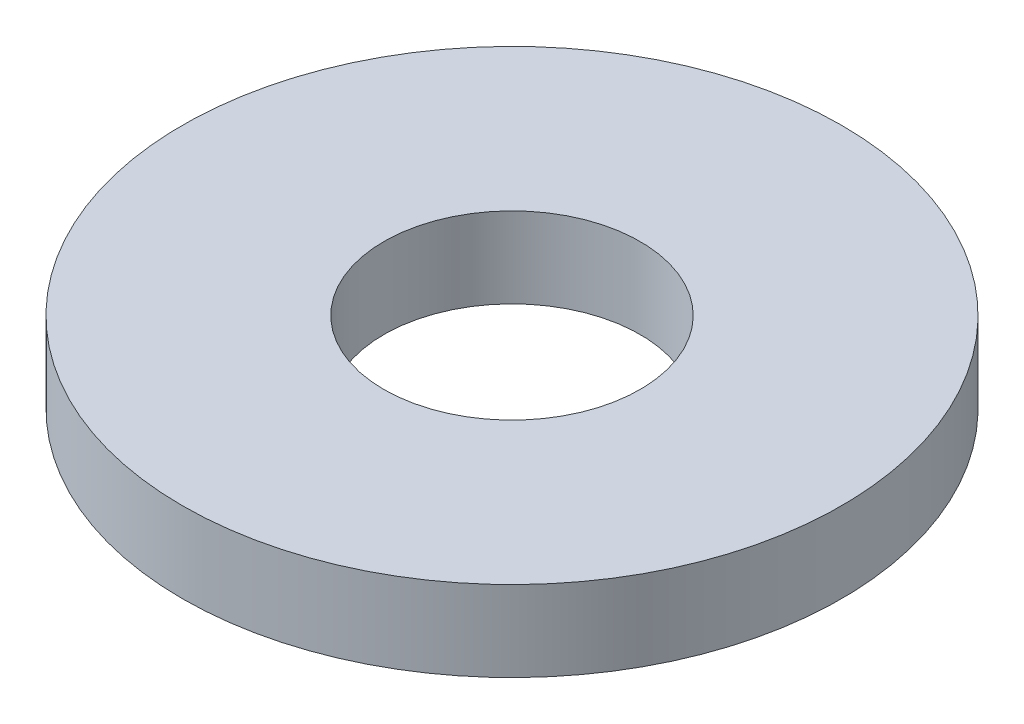
ISO-10303-21;
HEADER;
FILE_DESCRIPTION(('STEP AP214'),'2;1');
FILE_NAME('part.step','',(''),(''),'','','');
FILE_SCHEMA(('AUTOMOTIVE_DESIGN { 1 0 10303 214 1 1 1 1 }'));
ENDSEC;
DATA;
#1=APPLICATION_CONTEXT('core data for automotive mechanical design processes');
#2=APPLICATION_PROTOCOL_DEFINITION('international standard','automotive_design',2000,#1);
#3=PRODUCT_CONTEXT('',#1,'mechanical');
#4=PRODUCT('Part','Part','',(#3));
#5=PRODUCT_RELATED_PRODUCT_CATEGORY('part','',(#4));
#6=PRODUCT_DEFINITION_FORMATION('','',#4);
#7=PRODUCT_DEFINITION_CONTEXT('part definition',#1,'design');
#8=PRODUCT_DEFINITION('design','',#6,#7);
#9=PRODUCT_DEFINITION_SHAPE('','',#8);
#10=(LENGTH_UNIT() NAMED_UNIT(*) SI_UNIT(.MILLI.,.METRE.));
#11=(NAMED_UNIT(*) PLANE_ANGLE_UNIT() SI_UNIT($,.RADIAN.));
#12=(NAMED_UNIT(*) SI_UNIT($,.STERADIAN.) SOLID_ANGLE_UNIT());
#13=UNCERTAINTY_MEASURE_WITH_UNIT(LENGTH_MEASURE(1.E-05),#10,'distance_accuracy_value','');
#14=(GEOMETRIC_REPRESENTATION_CONTEXT(3) GLOBAL_UNCERTAINTY_ASSIGNED_CONTEXT((#13)) GLOBAL_UNIT_ASSIGNED_CONTEXT((#10,
#11,#12)) REPRESENTATION_CONTEXT('',''));
#15=CARTESIAN_POINT('',(0.,0.,0.));
#16=DIRECTION('',(0.,0.,1.));
#17=DIRECTION('',(1.,0.,0.));
#18=AXIS2_PLACEMENT_3D('',#15,#16,#17);
#19=CARTESIAN_POINT('',(0.,11.,0.));
#20=DIRECTION('',(0.,-1.,0.));
#21=DIRECTION('',(0.,0.,-1.));
#22=AXIS2_PLACEMENT_3D('',#19,#20,#21);
#23=CYLINDRICAL_SURFACE('',#22,45.);
#24=CARTESIAN_POINT('',(0.,11.,0.));
#25=DIRECTION('',(0.,1.,0.));
#26=DIRECTION('',(0.,0.,1.));
#27=AXIS2_PLACEMENT_3D('',#24,#25,#26);
#28=CIRCLE('',#27,45.);
#29=CARTESIAN_POINT('',(0.,11.,45.));
#30=VERTEX_POINT('',#29);
#31=EDGE_CURVE('E10',#30,#30,#28,.T.);
#32=ORIENTED_EDGE('',*,*,#31,.F.);
#33=EDGE_LOOP('',(#32));
#34=FACE_BOUND('',#33,.T.);
#35=CARTESIAN_POINT('',(0.,0.,0.));
#36=DIRECTION('',(0.,1.,0.));
#37=DIRECTION('',(0.,0.,1.));
#38=AXIS2_PLACEMENT_3D('',#35,#36,#37);
#39=CIRCLE('',#38,45.);
#40=CARTESIAN_POINT('',(0.,0.,45.));
#41=VERTEX_POINT('',#40);
#42=EDGE_CURVE('E37',#41,#41,#39,.T.);
#43=ORIENTED_EDGE('',*,*,#42,.T.);
#44=EDGE_LOOP('',(#43));
#45=FACE_BOUND('',#44,.T.);
#46=ADVANCED_FACE('F40',(#34,#45),#23,.T.);
#47=CARTESIAN_POINT('',(0.,11.,0.));
#48=DIRECTION('',(0.,1.,0.));
#49=DIRECTION('',(0.,0.,1.));
#50=AXIS2_PLACEMENT_3D('',#47,#48,#49);
#51=PLANE('',#50);
#52=CARTESIAN_POINT('',(0.,11.,0.));
#53=DIRECTION('',(0.,1.,0.));
#54=DIRECTION('',(0.,0.,1.));
#55=AXIS2_PLACEMENT_3D('',#52,#53,#54);
#56=CIRCLE('',#55,17.5);
#57=CARTESIAN_POINT('',(0.,11.,17.5));
#58=VERTEX_POINT('',#57);
#59=EDGE_CURVE('E50',#58,#58,#56,.T.);
#60=ORIENTED_EDGE('',*,*,#59,.F.);
#61=EDGE_LOOP('',(#60));
#62=FACE_BOUND('',#61,.T.);
#63=ORIENTED_EDGE('',*,*,#31,.T.);
#64=EDGE_LOOP('',(#63));
#65=FACE_BOUND('',#64,.T.);
#66=ADVANCED_FACE('F59',(#62,#65),#51,.T.);
#67=CARTESIAN_POINT('',(0.,0.,0.));
#68=DIRECTION('',(0.,1.,0.));
#69=DIRECTION('',(0.,0.,1.));
#70=AXIS2_PLACEMENT_3D('',#67,#68,#69);
#71=PLANE('',#70);
#72=CARTESIAN_POINT('',(0.,0.,0.));
#73=DIRECTION('',(0.,1.,0.));
#74=DIRECTION('',(0.,0.,1.));
#75=AXIS2_PLACEMENT_3D('',#72,#73,#74);
#76=CIRCLE('',#75,17.5);
#77=CARTESIAN_POINT('',(0.,0.,17.5));
#78=VERTEX_POINT('',#77);
#79=EDGE_CURVE('E47',#78,#78,#76,.T.);
#80=ORIENTED_EDGE('',*,*,#79,.T.);
#81=EDGE_LOOP('',(#80));
#82=FACE_BOUND('',#81,.T.);
#83=ORIENTED_EDGE('',*,*,#42,.F.);
#84=EDGE_LOOP('',(#83));
#85=FACE_BOUND('',#84,.T.);
#86=ADVANCED_FACE('F58',(#82,#85),#71,.F.);
#87=CARTESIAN_POINT('',(0.,11.,0.));
#88=DIRECTION('',(0.,-1.,0.));
#89=DIRECTION('',(0.,0.,-1.));
#90=AXIS2_PLACEMENT_3D('',#87,#88,#89);
#91=CYLINDRICAL_SURFACE('',#90,17.5);
#92=ORIENTED_EDGE('',*,*,#59,.T.);
#93=EDGE_LOOP('',(#92));
#94=FACE_BOUND('',#93,.T.);
#95=ORIENTED_EDGE('',*,*,#79,.F.);
#96=EDGE_LOOP('',(#95));
#97=FACE_BOUND('',#96,.T.);
#98=ADVANCED_FACE('F54',(#94,#97),#91,.F.);
#99=CLOSED_SHELL('',(#46,#66,#86,#98));
#100=MANIFOLD_SOLID_BREP('B2',#99);
#101=ADVANCED_BREP_SHAPE_REPRESENTATION('',(#18,#100),#14);
#102=SHAPE_DEFINITION_REPRESENTATION(#9,#101);
ENDSEC;
END-ISO-10303-21;
